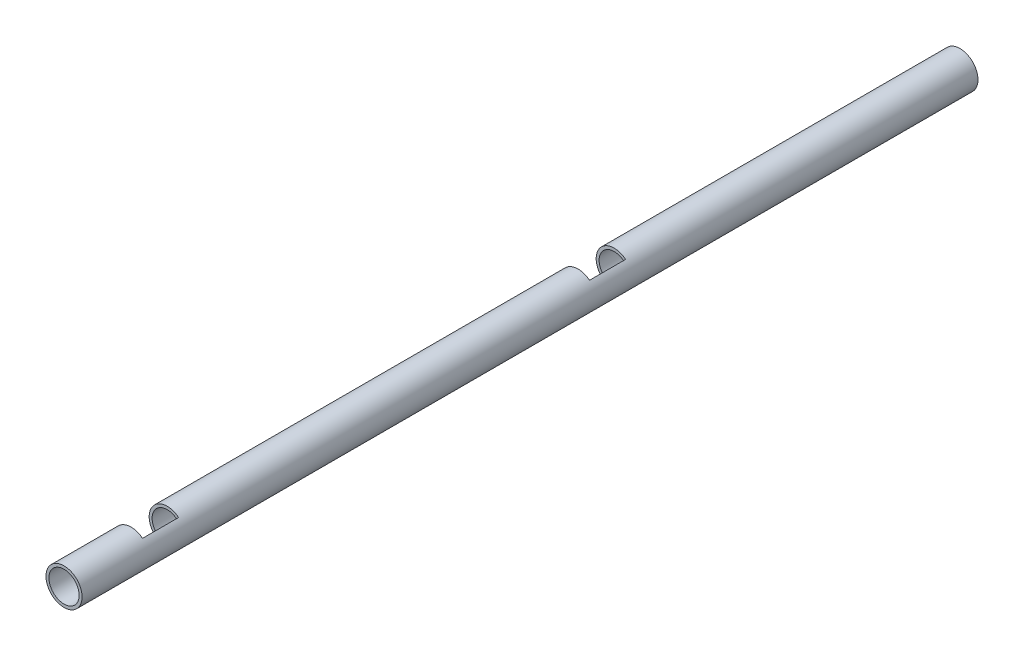
ISO-10303-21;
HEADER;
FILE_DESCRIPTION(('STEP AP214'),'2;1');
FILE_NAME('part.step','',(''),(''),'','','');
FILE_SCHEMA(('AUTOMOTIVE_DESIGN { 1 0 10303 214 1 1 1 1 }'));
ENDSEC;
DATA;
#1=APPLICATION_CONTEXT('core data for automotive mechanical design processes');
#2=APPLICATION_PROTOCOL_DEFINITION('international standard','automotive_design',2000,#1);
#3=PRODUCT_CONTEXT('',#1,'mechanical');
#4=PRODUCT('Part','Part','',(#3));
#5=PRODUCT_RELATED_PRODUCT_CATEGORY('part','',(#4));
#6=PRODUCT_DEFINITION_FORMATION('','',#4);
#7=PRODUCT_DEFINITION_CONTEXT('part definition',#1,'design');
#8=PRODUCT_DEFINITION('design','',#6,#7);
#9=PRODUCT_DEFINITION_SHAPE('','',#8);
#10=(LENGTH_UNIT() NAMED_UNIT(*) SI_UNIT(.MILLI.,.METRE.));
#11=(NAMED_UNIT(*) PLANE_ANGLE_UNIT() SI_UNIT($,.RADIAN.));
#12=(NAMED_UNIT(*) SI_UNIT($,.STERADIAN.) SOLID_ANGLE_UNIT());
#13=UNCERTAINTY_MEASURE_WITH_UNIT(LENGTH_MEASURE(1.E-05),#10,'distance_accuracy_value','');
#14=(GEOMETRIC_REPRESENTATION_CONTEXT(3) GLOBAL_UNCERTAINTY_ASSIGNED_CONTEXT((#13)) GLOBAL_UNIT_ASSIGNED_CONTEXT((#10,
#11,#12)) REPRESENTATION_CONTEXT('',''));
#15=CARTESIAN_POINT('',(0.,0.,0.));
#16=DIRECTION('',(0.,0.,1.));
#17=DIRECTION('',(1.,0.,0.));
#18=AXIS2_PLACEMENT_3D('',#15,#16,#17);
#19=CARTESIAN_POINT('',(0.3932,0.481952030808046,0.933));
#20=DIRECTION('',(-0.774842493260524,0.632154340836013,0.));
#21=DIRECTION('',(0.,0.,1.));
#22=AXIS2_PLACEMENT_3D('',#19,#20,#21);
#23=PLANE('',#22);
#24=DIRECTION('',(0.632154340836013,0.774842493260524,0.));
#25=VECTOR('',#24,1.);
#26=CARTESIAN_POINT('',(0.3932,0.481952030808046,0.311));
#27=LINE('',#26,#25);
#28=CARTESIAN_POINT('',(0.3291084,0.403393849786335,0.311));
#29=VERTEX_POINT('',#28);
#30=CARTESIAN_POINT('',(0.3932,0.481952030808046,0.311));
#31=VERTEX_POINT('',#30);
#32=EDGE_CURVE('E50',#29,#31,#27,.T.);
#33=ORIENTED_EDGE('',*,*,#32,.F.);
#34=DIRECTION('',(0.,0.,1.));
#35=VECTOR('',#34,1.);
#36=CARTESIAN_POINT('',(0.3291084,0.403393849786335,0.));
#37=LINE('',#36,#35);
#38=CARTESIAN_POINT('',(0.3291084,0.403393849786335,1.555));
#39=VERTEX_POINT('',#38);
#40=EDGE_CURVE('E94',#29,#39,#37,.T.);
#41=ORIENTED_EDGE('',*,*,#40,.T.);
#42=DIRECTION('',(0.632154340836013,0.774842493260524,0.));
#43=VECTOR('',#42,1.);
#44=CARTESIAN_POINT('',(0.3932,0.481952030808046,1.555));
#45=LINE('',#44,#43);
#46=CARTESIAN_POINT('',(0.3932,0.481952030808046,1.555));
#47=VERTEX_POINT('',#46);
#48=EDGE_CURVE('E68',#39,#47,#45,.T.);
#49=ORIENTED_EDGE('',*,*,#48,.T.);
#50=DIRECTION('',(0.,0.,1.));
#51=VECTOR('',#50,1.);
#52=CARTESIAN_POINT('',(0.3932,0.481952030808046,0.));
#53=LINE('',#52,#51);
#54=EDGE_CURVE('E146',#31,#47,#53,.T.);
#55=ORIENTED_EDGE('',*,*,#54,.F.);
#56=EDGE_LOOP('',(#33,#41,#49,#55));
#57=FACE_BOUND('',#56,.T.);
#58=ADVANCED_FACE('F37',(#57),#23,.T.);
#59=CARTESIAN_POINT('',(0.,0.,1.555));
#60=DIRECTION('',(0.,0.,1.));
#61=DIRECTION('',(1.,0.,0.));
#62=AXIS2_PLACEMENT_3D('',#59,#60,#61);
#63=PLANE('',#62);
#64=ORIENTED_EDGE('',*,*,#48,.F.);
#65=CARTESIAN_POINT('',(0.,0.,1.555));
#66=DIRECTION('',(0.,0.,1.));
#67=DIRECTION('',(1.,0.,0.));
#68=AXIS2_PLACEMENT_3D('',#65,#66,#67);
#69=CIRCLE('',#68,0.520614);
#70=CARTESIAN_POINT('',(0.3291084,-0.403393849786335,1.555));
#71=VERTEX_POINT('',#70);
#72=EDGE_CURVE('E150',#39,#71,#69,.T.);
#73=ORIENTED_EDGE('',*,*,#72,.T.);
#74=DIRECTION('',(0.632154340836013,-0.774842493260524,0.));
#75=VECTOR('',#74,1.);
#76=CARTESIAN_POINT('',(0.3932,-0.481952030808046,1.555));
#77=LINE('',#76,#75);
#78=CARTESIAN_POINT('',(0.3932,-0.481952030808046,1.555));
#79=VERTEX_POINT('',#78);
#80=EDGE_CURVE('E103',#71,#79,#77,.T.);
#81=ORIENTED_EDGE('',*,*,#80,.T.);
#82=CARTESIAN_POINT('',(0.,0.,1.555));
#83=DIRECTION('',(0.,0.,-1.));
#84=DIRECTION('',(-1.,0.,0.));
#85=AXIS2_PLACEMENT_3D('',#82,#83,#84);
#86=CIRCLE('',#85,0.622);
#87=EDGE_CURVE('E95',#47,#79,#86,.F.);
#88=ORIENTED_EDGE('',*,*,#87,.F.);
#89=EDGE_LOOP('',(#64,#73,#81,#88));
#90=FACE_BOUND('',#89,.T.);
#91=ADVANCED_FACE('F138',(#90),#63,.F.);
#92=CARTESIAN_POINT('',(0.,0.,0.311));
#93=DIRECTION('',(0.,0.,-1.));
#94=DIRECTION('',(-1.,0.,0.));
#95=AXIS2_PLACEMENT_3D('',#92,#93,#94);
#96=PLANE('',#95);
#97=CARTESIAN_POINT('',(0.,0.,0.311));
#98=DIRECTION('',(0.,0.,1.));
#99=DIRECTION('',(1.,0.,0.));
#100=AXIS2_PLACEMENT_3D('',#97,#98,#99);
#101=CIRCLE('',#100,0.520614);
#102=CARTESIAN_POINT('',(0.3291084,-0.403393849786335,0.311));
#103=VERTEX_POINT('',#102);
#104=EDGE_CURVE('E87',#103,#29,#101,.F.);
#105=ORIENTED_EDGE('',*,*,#104,.T.);
#106=ORIENTED_EDGE('',*,*,#32,.T.);
#107=CARTESIAN_POINT('',(0.,0.,0.311));
#108=DIRECTION('',(0.,0.,1.));
#109=DIRECTION('',(1.,0.,0.));
#110=AXIS2_PLACEMENT_3D('',#107,#108,#109);
#111=CIRCLE('',#110,0.622);
#112=CARTESIAN_POINT('',(0.3932,-0.481952030808046,0.311));
#113=VERTEX_POINT('',#112);
#114=EDGE_CURVE('E74',#113,#31,#111,.F.);
#115=ORIENTED_EDGE('',*,*,#114,.F.);
#116=DIRECTION('',(0.632154340836013,-0.774842493260524,0.));
#117=VECTOR('',#116,1.);
#118=CARTESIAN_POINT('',(0.3932,-0.481952030808046,0.311));
#119=LINE('',#118,#117);
#120=EDGE_CURVE('E101',#103,#113,#119,.T.);
#121=ORIENTED_EDGE('',*,*,#120,.F.);
#122=EDGE_LOOP('',(#105,#106,#115,#121));
#123=FACE_BOUND('',#122,.T.);
#124=ADVANCED_FACE('F39',(#123),#96,.F.);
#125=CARTESIAN_POINT('',(0.,0.,0.));
#126=DIRECTION('',(0.,0.,1.));
#127=DIRECTION('',(1.,0.,0.));
#128=AXIS2_PLACEMENT_3D('',#125,#126,#127);
#129=CYLINDRICAL_SURFACE('',#128,0.622);
#130=CARTESIAN_POINT('',(-0.622,0.,3.255));
#131=CARTESIAN_POINT('',(-0.621999577929827,0.0109193633288384,3.25499939308507));
#132=CARTESIAN_POINT('',(-0.621709329938003,0.0218502270294627,3.25410161503433));
#133=CARTESIAN_POINT('',(-0.620578112855119,0.0434024432020149,3.25054010866013));
#134=CARTESIAN_POINT('',(-0.619736207669613,0.0540232374685382,3.24787337854731));
#135=CARTESIAN_POINT('',(-0.617593869971351,0.0746246518911455,3.24087419082279));
#136=CARTESIAN_POINT('',(-0.616294450412361,0.084606629178181,3.23654541114978));
#137=CARTESIAN_POINT('',(-0.613370888019472,0.103699386181398,3.22635803819557));
#138=CARTESIAN_POINT('',(-0.611746791297651,0.112810289340036,3.22049966211826));
#139=CARTESIAN_POINT('',(-0.608286102372988,0.130203719158425,3.20721765206123));
#140=CARTESIAN_POINT('',(-0.606444663928166,0.138453985198494,3.19975303528528));
#141=CARTESIAN_POINT('',(-0.602784240920798,0.153610144329197,3.18355730894605));
#142=CARTESIAN_POINT('',(-0.600965262165017,0.160515696300347,3.17482587900247));
#143=CARTESIAN_POINT('',(-0.597503530771229,0.172963818804696,3.15606209326497));
#144=CARTESIAN_POINT('',(-0.595866696764659,0.178465603211153,3.14600148309368));
#145=CARTESIAN_POINT('',(-0.59302745289626,0.187685596399211,3.12503670826931));
#146=CARTESIAN_POINT('',(-0.591824918677886,0.191404315840202,3.11413278617599));
#147=CARTESIAN_POINT('',(-0.590041030843827,0.196833859126491,3.09215455937568));
#148=CARTESIAN_POINT('',(-0.589441214579351,0.198604530142793,3.08109658086054));
#149=CARTESIAN_POINT('',(-0.588875945894283,0.200274737992443,3.05882547613999));
#150=CARTESIAN_POINT('',(-0.588910313539343,0.200174805564168,3.04761239484344));
#151=CARTESIAN_POINT('',(-0.5895932815845,0.198153311328794,3.02585096574481));
#152=CARTESIAN_POINT('',(-0.590215937903086,0.196308688317999,3.01529451770903));
#153=CARTESIAN_POINT('',(-0.591963052928187,0.190975230611651,2.99464966713254));
#154=CARTESIAN_POINT('',(-0.593087570309907,0.187486203657546,2.9845613194722));
#155=CARTESIAN_POINT('',(-0.595731017518543,0.178910257031212,2.96495920845102));
#156=CARTESIAN_POINT('',(-0.597255714099062,0.173799725062294,2.95545658672679));
#157=CARTESIAN_POINT('',(-0.600525069528976,0.162142523518303,2.9374194725291));
#158=CARTESIAN_POINT('',(-0.602269776064023,0.155595542374401,2.92888519070081));
#159=CARTESIAN_POINT('',(-0.605885585651294,0.140878299077212,2.91259381155107));
#160=CARTESIAN_POINT('',(-0.607758727443434,0.132645000236176,2.90489400937033));
#161=CARTESIAN_POINT('',(-0.611347152244488,0.11497740187755,2.8909672538188));
#162=CARTESIAN_POINT('',(-0.613062366497891,0.105542583485075,2.8847409401126));
#163=CARTESIAN_POINT('',(-0.616161845004992,0.085621864039235,2.87389576386484));
#164=CARTESIAN_POINT('',(-0.617542856982662,0.0751269410421353,2.86929251303984));
#165=CARTESIAN_POINT('',(-0.619792686366073,0.0534683769053918,2.8619420636265));
#166=CARTESIAN_POINT('',(-0.620662554643341,0.0423061601262099,2.85919105526121));
#167=CARTESIAN_POINT('',(-0.62148320570485,0.0258683835589917,2.85661195013316));
#168=CARTESIAN_POINT('',(-0.621676438455423,0.0207159916137967,2.856008193597));
#169=CARTESIAN_POINT('',(-0.621934936052819,0.0103765990587501,2.85520207383045));
#170=CARTESIAN_POINT('',(-0.622000200595461,0.00518959836666247,2.85499971155417));
#171=CARTESIAN_POINT('',(-0.621999577929833,-0.0109193633288352,2.85500060691491));
#172=CARTESIAN_POINT('',(-0.621709329938004,-0.0218502270294587,2.85589838496567));
#173=CARTESIAN_POINT('',(-0.620578112855118,-0.043402443202011,2.85945989133988));
#174=CARTESIAN_POINT('',(-0.619736207669612,-0.0540232374685351,2.86212662145269));
#175=CARTESIAN_POINT('',(-0.617593869971352,-0.0746246518911436,2.86912580917721));
#176=CARTESIAN_POINT('',(-0.616294450412361,-0.0846066291781793,2.87345458885023));
#177=CARTESIAN_POINT('',(-0.613370888019472,-0.103699386181397,2.88364196180443));
#178=CARTESIAN_POINT('',(-0.611746791297651,-0.112810289340034,2.88950033788174));
#179=CARTESIAN_POINT('',(-0.608286102372988,-0.130203719158423,2.90278234793877));
#180=CARTESIAN_POINT('',(-0.606444663928167,-0.138453985198492,2.91024696471473));
#181=CARTESIAN_POINT('',(-0.602784240920799,-0.153610144329195,2.92644269105395));
#182=CARTESIAN_POINT('',(-0.600965262165018,-0.160515696300345,2.93517412099753));
#183=CARTESIAN_POINT('',(-0.597503530771229,-0.172963818804695,2.95393790673503));
#184=CARTESIAN_POINT('',(-0.595866696764659,-0.178465603211152,2.96399851690632));
#185=CARTESIAN_POINT('',(-0.59302745289626,-0.18768559639921,2.98496329173069));
#186=CARTESIAN_POINT('',(-0.591824918677886,-0.191404315840201,2.99586721382401));
#187=CARTESIAN_POINT('',(-0.590041030843827,-0.19683385912649,3.01784544062433));
#188=CARTESIAN_POINT('',(-0.589441214579351,-0.198604530142793,3.02890341913946));
#189=CARTESIAN_POINT('',(-0.588875945894283,-0.200274737992443,3.05117452386001));
#190=CARTESIAN_POINT('',(-0.588910313539343,-0.200174805564168,3.06238760515656));
#191=CARTESIAN_POINT('',(-0.589593281584499,-0.198153311328794,3.08414903425519));
#192=CARTESIAN_POINT('',(-0.590215937903085,-0.196308688317999,3.09470548229098));
#193=CARTESIAN_POINT('',(-0.591963052928186,-0.190975230611652,3.11535033286747));
#194=CARTESIAN_POINT('',(-0.593087570309907,-0.187486203657546,3.12543868052781));
#195=CARTESIAN_POINT('',(-0.595731017518543,-0.178910257031213,3.14504079154898));
#196=CARTESIAN_POINT('',(-0.597255714099062,-0.173799725062295,3.15454341327321));
#197=CARTESIAN_POINT('',(-0.600525069528976,-0.162142523518304,3.1725805274709));
#198=CARTESIAN_POINT('',(-0.602269776064023,-0.155595542374403,3.1811148092992));
#199=CARTESIAN_POINT('',(-0.605885585651293,-0.140878299077214,3.19740618844893));
#200=CARTESIAN_POINT('',(-0.607758727443434,-0.132645000236178,3.20510599062967));
#201=CARTESIAN_POINT('',(-0.611347152244487,-0.114977401877552,3.2190327461812));
#202=CARTESIAN_POINT('',(-0.613062366497891,-0.105542583485077,3.2252590598874));
#203=CARTESIAN_POINT('',(-0.616161845004992,-0.0856218640392371,3.23610423613517));
#204=CARTESIAN_POINT('',(-0.617542856982662,-0.0751269410421372,3.24070748696017));
#205=CARTESIAN_POINT('',(-0.619792686366072,-0.0534683769053936,3.2480579363735));
#206=CARTESIAN_POINT('',(-0.62066255464334,-0.0423061601262121,3.25080894473879));
#207=CARTESIAN_POINT('',(-0.62148320570485,-0.0258683835589938,3.25338804986684));
#208=CARTESIAN_POINT('',(-0.621676438455424,-0.0207159916137982,3.253991806403));
#209=CARTESIAN_POINT('',(-0.621934936052818,-0.0103765990587499,3.25479792616955));
#210=CARTESIAN_POINT('',(-0.622000200595457,-0.00518959836666119,3.25500028844582));
#211=CARTESIAN_POINT('',(-0.622,0.,3.255));
#212=B_SPLINE_CURVE_WITH_KNOTS('',3,(#130,#131,#132,#133,#134,#135,#136,#137,#138,#139,#140,
#141,#142,#143,#144,#145,#146,#147,#148,#149,#150,#151,#152,#153,#154,#155,#156,#157,#158,#159,
#160,#161,#162,#163,#164,#165,#166,#167,#168,#169,#170,#171,#172,#173,#174,#175,#176,#177,#178,
#179,#180,#181,#182,#183,#184,#185,#186,#187,#188,#189,#190,#191,#192,#193,#194,#195,#196,#197,
#198,#199,#200,#201,#202,#203,#204,#205,#206,#207,#208,#209,#210,#211),.UNSPECIFIED.,.T.,.F.,(4,
2,2,2,2,2,2,2,2,2,2,2,2,2,2,2,2,2,2,2,2,2,2,2,2,2,2,2,2,2,2,2,2,2,2,2,2,2,2,2,4),(0.,
0.0327380856553518,0.0655318681835637,0.0982534959600798,0.130970479764623,0.164650092297729,
0.198338237386976,0.232915564706204,0.267482983357219,0.300955906343575,0.334419332343534,
0.366472648404573,0.398529712968826,0.431076848275393,0.463631050114921,0.497754520395141,
0.531892777149167,0.566350973681964,0.600738076718817,0.616297327462757,0.631856615191181,
0.664594700846532,0.697388483374746,0.730110111151263,0.762827094955805,0.79650670748891,
0.830194852578158,0.864772179897386,0.899339598548402,0.932812521534758,0.966275947534716,
0.998329263595756,1.03038632816001,1.06293346346658,1.0954876653061,1.12961113558632,
1.16374939234035,1.19820758887315,1.23259469191,1.24815394265394,1.26371323038237),.UNSPECIFIED.);
#213=CARTESIAN_POINT('',(-0.622,0.,3.255));
#214=VERTEX_POINT('',#213);
#215=EDGE_CURVE('E107',#214,#214,#212,.T.);
#216=ORIENTED_EDGE('',*,*,#215,.F.);
#217=EDGE_LOOP('',(#216));
#218=FACE_BOUND('',#217,.T.);
#219=CARTESIAN_POINT('',(0.,0.,3.866));
#220=DIRECTION('',(0.,0.,1.));
#221=DIRECTION('',(1.,0.,0.));
#222=AXIS2_PLACEMENT_3D('',#219,#220,#221);
#223=CIRCLE('',#222,0.622);
#224=CARTESIAN_POINT('',(0.622,0.,3.866));
#225=VERTEX_POINT('',#224);
#226=EDGE_CURVE('E110',#225,#225,#223,.T.);
#227=ORIENTED_EDGE('',*,*,#226,.F.);
#228=EDGE_LOOP('',(#227));
#229=FACE_BOUND('',#228,.T.);
#230=ORIENTED_EDGE('',*,*,#87,.T.);
#231=DIRECTION('',(0.,0.,1.));
#232=VECTOR('',#231,1.);
#233=CARTESIAN_POINT('',(0.3932,-0.481952030808046,0.));
#234=LINE('',#233,#232);
#235=EDGE_CURVE('E104',#113,#79,#234,.T.);
#236=ORIENTED_EDGE('',*,*,#235,.F.);
#237=ORIENTED_EDGE('',*,*,#114,.T.);
#238=ORIENTED_EDGE('',*,*,#54,.T.);
#239=EDGE_LOOP('',(#230,#236,#237,#238));
#240=FACE_BOUND('',#239,.T.);
#241=CARTESIAN_POINT('',(-0.622000000000004,0.,-12.145));
#242=CARTESIAN_POINT('',(-0.621999577929831,0.0109193633288384,-12.1450006069149));
#243=CARTESIAN_POINT('',(-0.621709329938006,0.0218502270294627,-12.1458983849657));
#244=CARTESIAN_POINT('',(-0.620578112855123,0.0434024432020148,-12.1494598913399));
#245=CARTESIAN_POINT('',(-0.619736207669616,0.0540232374685382,-12.1521266214527));
#246=CARTESIAN_POINT('',(-0.617593869971355,0.0746246518911454,-12.1591258091772));
#247=CARTESIAN_POINT('',(-0.616294450412364,0.0846066291781807,-12.1634545888502));
#248=CARTESIAN_POINT('',(-0.613370888019476,0.103699386181398,-12.1736419618044));
#249=CARTESIAN_POINT('',(-0.611746791297655,0.112810289340036,-12.1795003378817));
#250=CARTESIAN_POINT('',(-0.608286102372991,0.130203719158425,-12.1927823479388));
#251=CARTESIAN_POINT('',(-0.60644466392817,0.138453985198494,-12.2002469647147));
#252=CARTESIAN_POINT('',(-0.602784240920802,0.153610144329197,-12.2164426910539));
#253=CARTESIAN_POINT('',(-0.600965262165021,0.160515696300347,-12.2251741209975));
#254=CARTESIAN_POINT('',(-0.597503530771232,0.172963818804696,-12.243937906735));
#255=CARTESIAN_POINT('',(-0.595866696764663,0.178465603211153,-12.2539985169063));
#256=CARTESIAN_POINT('',(-0.593027452896264,0.187685596399211,-12.2749632917307));
#257=CARTESIAN_POINT('',(-0.59182491867789,0.191404315840202,-12.285867213824));
#258=CARTESIAN_POINT('',(-0.590041030843831,0.196833859126491,-12.3078454406243));
#259=CARTESIAN_POINT('',(-0.589441214579355,0.198604530142793,-12.3189034191395));
#260=CARTESIAN_POINT('',(-0.588875945894287,0.200274737992443,-12.34117452386));
#261=CARTESIAN_POINT('',(-0.588910313539347,0.200174805564168,-12.3523876051566));
#262=CARTESIAN_POINT('',(-0.589593281584503,0.198153311328794,-12.3741490342552));
#263=CARTESIAN_POINT('',(-0.590215937903089,0.196308688317999,-12.384705482291));
#264=CARTESIAN_POINT('',(-0.59196305292819,0.190975230611651,-12.4053503328675));
#265=CARTESIAN_POINT('',(-0.593087570309911,0.187486203657546,-12.4154386805278));
#266=CARTESIAN_POINT('',(-0.595731017518547,0.178910257031212,-12.435040791549));
#267=CARTESIAN_POINT('',(-0.597255714099066,0.173799725062293,-12.4445434132732));
#268=CARTESIAN_POINT('',(-0.60052506952898,0.162142523518302,-12.4625805274709));
#269=CARTESIAN_POINT('',(-0.602269776064027,0.155595542374401,-12.4711148092992));
#270=CARTESIAN_POINT('',(-0.605885585651297,0.140878299077212,-12.4874061884489));
#271=CARTESIAN_POINT('',(-0.607758727443438,0.132645000236176,-12.4951059906297));
#272=CARTESIAN_POINT('',(-0.611347152244492,0.114977401877549,-12.5090327461812));
#273=CARTESIAN_POINT('',(-0.613062366497895,0.105542583485074,-12.5152590598874));
#274=CARTESIAN_POINT('',(-0.616161845004996,0.0856218640392351,-12.5261042361352));
#275=CARTESIAN_POINT('',(-0.617542856982666,0.0751269410421355,-12.5307074869602));
#276=CARTESIAN_POINT('',(-0.619792686366076,0.0534683769053919,-12.5380579363735));
#277=CARTESIAN_POINT('',(-0.620662554643345,0.0423061601262099,-12.5408089447388));
#278=CARTESIAN_POINT('',(-0.621483205704854,0.0258683835589917,-12.5433880498668));
#279=CARTESIAN_POINT('',(-0.621676438455426,0.0207159916137967,-12.543991806403));
#280=CARTESIAN_POINT('',(-0.621934936052822,0.0103765990587501,-12.5447979261696));
#281=CARTESIAN_POINT('',(-0.622000200595464,0.00518959836666247,-12.5450002884458));
#282=CARTESIAN_POINT('',(-0.621999577929837,-0.0109193633288349,-12.5449993930851));
#283=CARTESIAN_POINT('',(-0.621709329938008,-0.0218502270294583,-12.5441016150343));
#284=CARTESIAN_POINT('',(-0.620578112855122,-0.0434024432020105,-12.5405401086601));
#285=CARTESIAN_POINT('',(-0.619736207669616,-0.0540232374685349,-12.5378733785473));
#286=CARTESIAN_POINT('',(-0.617593869971355,-0.074624651891143,-12.5308741908228));
#287=CARTESIAN_POINT('',(-0.616294450412365,-0.0846066291781782,-12.5265454111498));
#288=CARTESIAN_POINT('',(-0.613370888019476,-0.103699386181396,-12.5163580381956));
#289=CARTESIAN_POINT('',(-0.611746791297655,-0.112810289340034,-12.5104996621183));
#290=CARTESIAN_POINT('',(-0.608286102372992,-0.130203719158423,-12.4972176520612));
#291=CARTESIAN_POINT('',(-0.60644466392817,-0.138453985198491,-12.4897530352853));
#292=CARTESIAN_POINT('',(-0.602784240920803,-0.153610144329195,-12.4735573089461));
#293=CARTESIAN_POINT('',(-0.600965262165021,-0.160515696300345,-12.4648258790025));
#294=CARTESIAN_POINT('',(-0.597503530771233,-0.172963818804695,-12.446062093265));
#295=CARTESIAN_POINT('',(-0.595866696764663,-0.178465603211151,-12.4360014830937));
#296=CARTESIAN_POINT('',(-0.593027452896264,-0.18768559639921,-12.4150367082693));
#297=CARTESIAN_POINT('',(-0.59182491867789,-0.191404315840201,-12.404132786176));
#298=CARTESIAN_POINT('',(-0.590041030843831,-0.19683385912649,-12.3821545593757));
#299=CARTESIAN_POINT('',(-0.589441214579355,-0.198604530142793,-12.3710965808605));
#300=CARTESIAN_POINT('',(-0.588875945894287,-0.200274737992443,-12.34882547614));
#301=CARTESIAN_POINT('',(-0.588910313539347,-0.200174805564168,-12.3376123948434));
#302=CARTESIAN_POINT('',(-0.589593281584503,-0.198153311328795,-12.3158509657448));
#303=CARTESIAN_POINT('',(-0.590215937903089,-0.196308688318,-12.305294517709));
#304=CARTESIAN_POINT('',(-0.59196305292819,-0.190975230611652,-12.2846496671325));
#305=CARTESIAN_POINT('',(-0.59308757030991,-0.187486203657547,-12.2745613194722));
#306=CARTESIAN_POINT('',(-0.595731017518547,-0.178910257031213,-12.254959208451));
#307=CARTESIAN_POINT('',(-0.597255714099066,-0.173799725062294,-12.2454565867268));
#308=CARTESIAN_POINT('',(-0.60052506952898,-0.162142523518303,-12.2274194725291));
#309=CARTESIAN_POINT('',(-0.602269776064027,-0.155595542374402,-12.2188851907008));
#310=CARTESIAN_POINT('',(-0.605885585651297,-0.140878299077214,-12.2025938115511));
#311=CARTESIAN_POINT('',(-0.607758727443438,-0.132645000236178,-12.1948940093703));
#312=CARTESIAN_POINT('',(-0.611347152244491,-0.114977401877552,-12.1809672538188));
#313=CARTESIAN_POINT('',(-0.613062366497894,-0.105542583485077,-12.1747409401126));
#314=CARTESIAN_POINT('',(-0.616161845004996,-0.0856218640392372,-12.1638957638648));
#315=CARTESIAN_POINT('',(-0.617542856982666,-0.0751269410421374,-12.1592925130398));
#316=CARTESIAN_POINT('',(-0.619792686366076,-0.053468376905394,-12.1519420636265));
#317=CARTESIAN_POINT('',(-0.620662554643344,-0.0423061601262123,-12.1491910552612));
#318=CARTESIAN_POINT('',(-0.621483205704854,-0.0258683835589938,-12.1466119501332));
#319=CARTESIAN_POINT('',(-0.621676438455427,-0.0207159916137983,-12.146008193597));
#320=CARTESIAN_POINT('',(-0.621934936052822,-0.01037659905875,-12.1452020738304));
#321=CARTESIAN_POINT('',(-0.622000200595461,-0.00518959836666123,-12.1449997115542));
#322=CARTESIAN_POINT('',(-0.622000000000004,0.,-12.145));
#323=B_SPLINE_CURVE_WITH_KNOTS('',3,(#241,#242,#243,#244,#245,#246,#247,#248,#249,#250,#251,
#252,#253,#254,#255,#256,#257,#258,#259,#260,#261,#262,#263,#264,#265,#266,#267,#268,#269,#270,
#271,#272,#273,#274,#275,#276,#277,#278,#279,#280,#281,#282,#283,#284,#285,#286,#287,#288,#289,
#290,#291,#292,#293,#294,#295,#296,#297,#298,#299,#300,#301,#302,#303,#304,#305,#306,#307,#308,
#309,#310,#311,#312,#313,#314,#315,#316,#317,#318,#319,#320,#321,#322),.UNSPECIFIED.,.T.,.F.,(4,
2,2,2,2,2,2,2,2,2,2,2,2,2,2,2,2,2,2,2,2,2,2,2,2,2,2,2,2,2,2,2,2,2,2,2,2,2,2,2,4),(0.,
0.0327380856553516,0.065531868183564,0.0982534959600798,0.130970479764622,0.164650092297729,
0.198338237386975,0.232915564706203,0.26748298335722,0.300955906343575,0.334419332343534,
0.366472648404573,0.398529712968826,0.431076848275393,0.463631050114921,0.497754520395142,
0.531892777149166,0.566350973681963,0.600738076718816,0.616297327462756,0.631856615191181,
0.664594700846531,0.697388483374746,0.730110111151261,0.762827094955804,0.79650670748891,
0.830194852578158,0.864772179897386,0.899339598548401,0.932812521534756,0.966275947534715,
0.998329263595755,1.03038632816001,1.06293346346658,1.0954876653061,1.12961113558632,
1.16374939234035,1.19820758887315,1.23259469191,1.24815394265394,1.26371323038237),.UNSPECIFIED.);
#324=CARTESIAN_POINT('',(-0.622000000000004,0.,-12.145));
#325=VERTEX_POINT('',#324);
#326=EDGE_CURVE('E166',#325,#325,#323,.T.);
#327=ORIENTED_EDGE('',*,*,#326,.F.);
#328=EDGE_LOOP('',(#327));
#329=FACE_BOUND('',#328,.T.);
#330=CARTESIAN_POINT('',(0.,0.,-13.845));
#331=DIRECTION('',(0.,0.,-1.));
#332=DIRECTION('',(-1.,0.,0.));
#333=AXIS2_PLACEMENT_3D('',#330,#331,#332);
#334=CIRCLE('',#333,0.622);
#335=CARTESIAN_POINT('',(0.393199999999996,0.481952030808046,-13.845));
#336=VERTEX_POINT('',#335);
#337=CARTESIAN_POINT('',(0.393199999999996,-0.481952030808046,-13.845));
#338=VERTEX_POINT('',#337);
#339=EDGE_CURVE('E173',#336,#338,#334,.F.);
#340=ORIENTED_EDGE('',*,*,#339,.T.);
#341=DIRECTION('',(0.,0.,1.));
#342=VECTOR('',#341,1.);
#343=CARTESIAN_POINT('',(0.393199999999996,-0.481952030808046,-15.4));
#344=LINE('',#343,#342);
#345=CARTESIAN_POINT('',(0.393199999999996,-0.481952030808046,-15.089));
#346=VERTEX_POINT('',#345);
#347=EDGE_CURVE('E271',#346,#338,#344,.T.);
#348=ORIENTED_EDGE('',*,*,#347,.F.);
#349=CARTESIAN_POINT('',(0.,0.,-15.089));
#350=DIRECTION('',(0.,0.,1.));
#351=DIRECTION('',(1.,0.,0.));
#352=AXIS2_PLACEMENT_3D('',#349,#350,#351);
#353=CIRCLE('',#352,0.622);
#354=CARTESIAN_POINT('',(0.393199999999996,0.481952030808046,-15.089));
#355=VERTEX_POINT('',#354);
#356=EDGE_CURVE('E196',#346,#355,#353,.F.);
#357=ORIENTED_EDGE('',*,*,#356,.T.);
#358=DIRECTION('',(0.,0.,1.));
#359=VECTOR('',#358,1.);
#360=CARTESIAN_POINT('',(0.393199999999996,0.481952030808046,-15.4));
#361=LINE('',#360,#359);
#362=EDGE_CURVE('E193',#355,#336,#361,.T.);
#363=ORIENTED_EDGE('',*,*,#362,.T.);
#364=EDGE_LOOP('',(#340,#348,#357,#363));
#365=FACE_BOUND('',#364,.T.);
#366=CARTESIAN_POINT('',(0.,0.,-27.));
#367=DIRECTION('',(0.,0.,-1.));
#368=DIRECTION('',(-1.,0.,0.));
#369=AXIS2_PLACEMENT_3D('',#366,#367,#368);
#370=CIRCLE('',#369,0.622);
#371=CARTESIAN_POINT('',(-0.622000000000004,0.,-27.));
#372=VERTEX_POINT('',#371);
#373=EDGE_CURVE('E177',#372,#372,#370,.T.);
#374=ORIENTED_EDGE('',*,*,#373,.F.);
#375=EDGE_LOOP('',(#374));
#376=FACE_BOUND('',#375,.T.);
#377=ADVANCED_FACE('F118',(#218,#229,#240,#329,#365,#376),#129,.T.);
#378=CARTESIAN_POINT('',(0.,0.,0.));
#379=DIRECTION('',(0.,0.,1.));
#380=DIRECTION('',(1.,0.,0.));
#381=AXIS2_PLACEMENT_3D('',#378,#379,#380);
#382=CYLINDRICAL_SURFACE('',#381,0.520614);
#383=CARTESIAN_POINT('',(-0.520614,0.,3.255));
#384=CARTESIAN_POINT('',(-0.520613514689114,0.0107956701120087,3.25499937381276));
#385=CARTESIAN_POINT('',(-0.520274634314805,0.0216012044258957,3.25412169078187));
#386=CARTESIAN_POINT('',(-0.518953603242681,0.0429001093390011,3.25064353234449));
#387=CARTESIAN_POINT('',(-0.517970491559685,0.0533929890741566,3.24804048318187));
#388=CARTESIAN_POINT('',(-0.515467170996157,0.0737382274317987,3.24121886699427));
#389=CARTESIAN_POINT('',(-0.513948400366225,0.0835922184170892,3.23700462352429));
#390=CARTESIAN_POINT('',(-0.510524407794475,0.102448673096471,3.22709816759491));
#391=CARTESIAN_POINT('',(-0.508619200560733,0.111451169180001,3.22140601138369));
#392=CARTESIAN_POINT('',(-0.504523374923858,0.128752900072884,3.2084411156542));
#393=CARTESIAN_POINT('',(-0.502324385367266,0.137009567903273,3.20111423454273));
#394=CARTESIAN_POINT('',(-0.497928940551434,0.152211856034185,3.18520255463404));
#395=CARTESIAN_POINT('',(-0.495732486539278,0.159156987475636,3.17661728889891));
#396=CARTESIAN_POINT('',(-0.4914925845933,0.171815042363856,3.15801064474767));
#397=CARTESIAN_POINT('',(-0.489458890180967,0.177466918989745,3.14794528888111));
#398=CARTESIAN_POINT('',(-0.485905241196104,0.186978631328272,3.12691659564903));
#399=CARTESIAN_POINT('',(-0.484385069683625,0.190839224034607,3.11595363991632));
#400=CARTESIAN_POINT('',(-0.482120130764399,0.196489388722502,3.093930258725));
#401=CARTESIAN_POINT('',(-0.48134507567526,0.198360218476035,3.08289390331718));
#402=CARTESIAN_POINT('',(-0.48056978092828,0.200231751889376,3.06063878623135));
#403=CARTESIAN_POINT('',(-0.480569199721746,0.200233279925003,3.04942010714231));
#404=CARTESIAN_POINT('',(-0.481316904110775,0.198428100816447,3.0278753438254));
#405=CARTESIAN_POINT('',(-0.482017784666322,0.196735858737024,3.01753771324575));
#406=CARTESIAN_POINT('',(-0.484010379390152,0.191780980630057,2.99730628041782));
#407=CARTESIAN_POINT('',(-0.485302189169175,0.188518090471456,2.98741255027597));
#408=CARTESIAN_POINT('',(-0.488358502567816,0.180454276834373,2.96812245420865));
#409=CARTESIAN_POINT('',(-0.490131736000887,0.175624590747232,2.95873955628492));
#410=CARTESIAN_POINT('',(-0.493948271745927,0.164584589481137,2.94088526995001));
#411=CARTESIAN_POINT('',(-0.495991658494739,0.158373842233771,2.93241416803002));
#412=CARTESIAN_POINT('',(-0.500294452493576,0.144231468047007,2.91599345908577));
#413=CARTESIAN_POINT('',(-0.502558920556002,0.136209242537717,2.90812301701501));
#414=CARTESIAN_POINT('',(-0.506925822119938,0.118930527519277,2.89381254534915));
#415=CARTESIAN_POINT('',(-0.509028179284183,0.109673462063506,2.88737318699076));
#416=CARTESIAN_POINT('',(-0.512879961730974,0.0899750494078034,2.87601390020555));
#417=CARTESIAN_POINT('',(-0.51462252956897,0.0795157371428964,2.87112268638634));
#418=CARTESIAN_POINT('',(-0.517504712621911,0.0578491298274874,2.86320339231079));
#419=CARTESIAN_POINT('',(-0.518645543355978,0.0466433945676825,2.86017155405159));
#420=CARTESIAN_POINT('',(-0.519813743081124,0.0294411677700754,2.85709050817924));
#421=CARTESIAN_POINT('',(-0.520112792421215,0.023585414928141,2.8563077511314));
#422=CARTESIAN_POINT('',(-0.520513053270646,0.0118207605769444,2.85526232687947));
#423=CARTESIAN_POINT('',(-0.520614265763031,0.00591185933192188,2.85499965709107));
#424=CARTESIAN_POINT('',(-0.520613514689164,-0.0107956701119829,2.85500062618711));
#425=CARTESIAN_POINT('',(-0.520274634314819,-0.021601204425864,2.85587830921809));
#426=CARTESIAN_POINT('',(-0.51895360324267,-0.0429001093389699,2.85935646765554));
#427=CARTESIAN_POINT('',(-0.517970491559684,-0.0533929890741315,2.86195951681814));
#428=CARTESIAN_POINT('',(-0.515467170996163,-0.0737382274317816,2.86878113300572));
#429=CARTESIAN_POINT('',(-0.513948400366228,-0.0835922184170742,2.87299537647571));
#430=CARTESIAN_POINT('',(-0.510524407794477,-0.102448673096457,2.88290183240509));
#431=CARTESIAN_POINT('',(-0.508619200560737,-0.111451169179984,2.8885939886163));
#432=CARTESIAN_POINT('',(-0.504523374923863,-0.128752900072867,2.90155888434579));
#433=CARTESIAN_POINT('',(-0.502324385367271,-0.137009567903256,2.90888576545726));
#434=CARTESIAN_POINT('',(-0.497928940551439,-0.152211856034169,2.92479744536594));
#435=CARTESIAN_POINT('',(-0.495732486539283,-0.159156987475621,2.93338271110108));
#436=CARTESIAN_POINT('',(-0.491492584593304,-0.171815042363845,2.95198935525232));
#437=CARTESIAN_POINT('',(-0.489458890180971,-0.177466918989734,2.96205471111888));
#438=CARTESIAN_POINT('',(-0.485905241196108,-0.186978631328264,2.98308340435095));
#439=CARTESIAN_POINT('',(-0.484385069683627,-0.190839224034599,2.99404636008367));
#440=CARTESIAN_POINT('',(-0.482120130764401,-0.196489388722498,3.01606974127498));
#441=CARTESIAN_POINT('',(-0.481345075675261,-0.198360218476031,3.0271060966828));
#442=CARTESIAN_POINT('',(-0.48056978092828,-0.200231751889376,3.04936121376864));
#443=CARTESIAN_POINT('',(-0.480569199721746,-0.200233279925004,3.06057989285768));
#444=CARTESIAN_POINT('',(-0.481316904110774,-0.19842810081645,3.08212465617459));
#445=CARTESIAN_POINT('',(-0.482017784666321,-0.196735858737028,3.09246228675423));
#446=CARTESIAN_POINT('',(-0.484010379390149,-0.191780980630063,3.11269371958217));
#447=CARTESIAN_POINT('',(-0.485302189169172,-0.188518090471463,3.12258744972402));
#448=CARTESIAN_POINT('',(-0.488358502567812,-0.180454276834382,3.14187754579134));
#449=CARTESIAN_POINT('',(-0.490131736000884,-0.175624590747241,3.15126044371507));
#450=CARTESIAN_POINT('',(-0.493948271745923,-0.164584589481148,3.16911473004997));
#451=CARTESIAN_POINT('',(-0.495991658494734,-0.158373842233784,3.17758583196996));
#452=CARTESIAN_POINT('',(-0.500294452493572,-0.144231468047023,3.19400654091422));
#453=CARTESIAN_POINT('',(-0.502558920555997,-0.136209242537736,3.20187698298498));
#454=CARTESIAN_POINT('',(-0.506925822119933,-0.118930527519298,3.21618745465084));
#455=CARTESIAN_POINT('',(-0.509028179284179,-0.109673462063527,3.22262681300923));
#456=CARTESIAN_POINT('',(-0.512879961730971,-0.0899750494078225,3.23398609979445));
#457=CARTESIAN_POINT('',(-0.514622529568969,-0.0795157371429135,3.23887731361366));
#458=CARTESIAN_POINT('',(-0.517504712621907,-0.0578491298275046,3.2467966076892));
#459=CARTESIAN_POINT('',(-0.518645543355971,-0.0466433945677021,3.24982844594839));
#460=CARTESIAN_POINT('',(-0.519813743081126,-0.0294411677700937,3.25290949182077));
#461=CARTESIAN_POINT('',(-0.520112792421223,-0.0235854149281546,3.25369224886862));
#462=CARTESIAN_POINT('',(-0.520513053270638,-0.0118207605769438,3.25473767312052));
#463=CARTESIAN_POINT('',(-0.520614265763001,-0.00591185933191159,3.25500034290886));
#464=CARTESIAN_POINT('',(-0.520614,0.,3.255));
#465=B_SPLINE_CURVE_WITH_KNOTS('',3,(#383,#384,#385,#386,#387,#388,#389,#390,#391,#392,#393,
#394,#395,#396,#397,#398,#399,#400,#401,#402,#403,#404,#405,#406,#407,#408,#409,#410,#411,#412,
#413,#414,#415,#416,#417,#418,#419,#420,#421,#422,#423,#424,#425,#426,#427,#428,#429,#430,#431,
#432,#433,#434,#435,#436,#437,#438,#439,#440,#441,#442,#443,#444,#445,#446,#447,#448,#449,#450,
#451,#452,#453,#454,#455,#456,#457,#458,#459,#460,#461,#462,#463,#464),.UNSPECIFIED.,.T.,.F.,(4,
2,2,2,2,2,2,2,2,2,2,2,2,2,2,2,2,2,2,2,2,2,2,2,2,2,2,2,2,2,2,2,2,2,2,2,2,2,2,2,4),(0.,
0.0323640931706409,0.0647765733542079,0.0971026799981972,0.129427556516402,0.163046166797802,
0.196677283375778,0.231665785134981,0.266639487312472,0.300122540074217,0.333590826557911,
0.364940387240169,0.396295021991101,0.428261331555216,0.460237655964197,0.494473823824757,
0.528726016113176,0.56358061511304,0.598364534951792,0.616087651254461,0.633810679491184,
0.666174772661818,0.698587252845399,0.730913359489395,0.763238236007592,0.796856846288989,
0.830487962866967,0.865476464626172,0.900450166803661,0.933933219565406,0.967401506049101,
0.99875106673136,1.03010570148229,1.06207201104641,1.09404833545539,1.12828450331594,
1.16253669560436,1.19739129460424,1.23217521444298,1.24989833074567,1.26762135898241),.UNSPECIFIED.);
#466=CARTESIAN_POINT('',(-0.520614,0.,3.255));
#467=VERTEX_POINT('',#466);
#468=EDGE_CURVE('E11',#467,#467,#465,.T.);
#469=ORIENTED_EDGE('',*,*,#468,.T.);
#470=EDGE_LOOP('',(#469));
#471=FACE_BOUND('',#470,.T.);
#472=CARTESIAN_POINT('',(0.,0.,3.866));
#473=DIRECTION('',(0.,0.,-1.));
#474=DIRECTION('',(1.,0.,0.));
#475=AXIS2_PLACEMENT_3D('',#472,#473,#474);
#476=CIRCLE('',#475,0.520614);
#477=CARTESIAN_POINT('',(0.520614,0.,3.866));
#478=VERTEX_POINT('',#477);
#479=EDGE_CURVE('E152',#478,#478,#476,.T.);
#480=ORIENTED_EDGE('',*,*,#479,.F.);
#481=EDGE_LOOP('',(#480));
#482=FACE_BOUND('',#481,.T.);
#483=DIRECTION('',(0.,0.,1.));
#484=VECTOR('',#483,1.);
#485=CARTESIAN_POINT('',(0.3291084,-0.403393849786335,0.));
#486=LINE('',#485,#484);
#487=EDGE_CURVE('E91',#103,#71,#486,.T.);
#488=ORIENTED_EDGE('',*,*,#487,.T.);
#489=ORIENTED_EDGE('',*,*,#72,.F.);
#490=ORIENTED_EDGE('',*,*,#40,.F.);
#491=ORIENTED_EDGE('',*,*,#104,.F.);
#492=EDGE_LOOP('',(#488,#489,#490,#491));
#493=FACE_BOUND('',#492,.T.);
#494=CARTESIAN_POINT('',(-0.520614000000004,0.,-12.145));
#495=CARTESIAN_POINT('',(-0.520613514689118,0.0107956701120088,-12.1450006261872));
#496=CARTESIAN_POINT('',(-0.520274634314808,0.0216012044258957,-12.1458783092181));
#497=CARTESIAN_POINT('',(-0.518953603242685,0.0429001093390012,-12.1493564676555));
#498=CARTESIAN_POINT('',(-0.517970491559689,0.0533929890741567,-12.1519595168181));
#499=CARTESIAN_POINT('',(-0.51546717099616,0.0737382274317986,-12.1587811330057));
#500=CARTESIAN_POINT('',(-0.513948400366229,0.0835922184170888,-12.1629953764757));
#501=CARTESIAN_POINT('',(-0.510524407794479,0.102448673096471,-12.1729018324051));
#502=CARTESIAN_POINT('',(-0.508619200560737,0.111451169180001,-12.1785939886163));
#503=CARTESIAN_POINT('',(-0.504523374923861,0.128752900072884,-12.1915588843458));
#504=CARTESIAN_POINT('',(-0.50232438536727,0.137009567903273,-12.1988857654573));
#505=CARTESIAN_POINT('',(-0.497928940551438,0.152211856034185,-12.214797445366));
#506=CARTESIAN_POINT('',(-0.495732486539282,0.159156987475636,-12.2233827111011));
#507=CARTESIAN_POINT('',(-0.491492584593304,0.171815042363857,-12.2419893552523));
#508=CARTESIAN_POINT('',(-0.48945889018097,0.177466918989745,-12.2520547111189));
#509=CARTESIAN_POINT('',(-0.485905241196108,0.186978631328272,-12.273083404351));
#510=CARTESIAN_POINT('',(-0.484385069683628,0.190839224034607,-12.2840463600837));
#511=CARTESIAN_POINT('',(-0.482120130764403,0.196489388722503,-12.306069741275));
#512=CARTESIAN_POINT('',(-0.481345075675264,0.198360218476035,-12.3171060966828));
#513=CARTESIAN_POINT('',(-0.480569780928284,0.200231751889376,-12.3393612137687));
#514=CARTESIAN_POINT('',(-0.48056919972175,0.200233279925003,-12.3505798928577));
#515=CARTESIAN_POINT('',(-0.481316904110779,0.198428100816447,-12.3721246561746));
#516=CARTESIAN_POINT('',(-0.482017784666326,0.196735858737024,-12.3824622867543));
#517=CARTESIAN_POINT('',(-0.484010379390156,0.191780980630057,-12.4026937195822));
#518=CARTESIAN_POINT('',(-0.485302189169178,0.188518090471456,-12.412587449724));
#519=CARTESIAN_POINT('',(-0.488358502567819,0.180454276834373,-12.4318775457914));
#520=CARTESIAN_POINT('',(-0.490131736000891,0.175624590747232,-12.4412604437151));
#521=CARTESIAN_POINT('',(-0.493948271745931,0.164584589481137,-12.45911473005));
#522=CARTESIAN_POINT('',(-0.495991658494742,0.158373842233771,-12.46758583197));
#523=CARTESIAN_POINT('',(-0.50029445249358,0.144231468047006,-12.4840065409142));
#524=CARTESIAN_POINT('',(-0.502558920556006,0.136209242537717,-12.491876982985));
#525=CARTESIAN_POINT('',(-0.506925822119941,0.118930527519277,-12.5061874546508));
#526=CARTESIAN_POINT('',(-0.509028179284187,0.109673462063506,-12.5126268130092));
#527=CARTESIAN_POINT('',(-0.512879961730978,0.0899750494078034,-12.5239860997945));
#528=CARTESIAN_POINT('',(-0.514622529568974,0.0795157371428967,-12.5288773136137));
#529=CARTESIAN_POINT('',(-0.517504712621915,0.0578491298274877,-12.5367966076892));
#530=CARTESIAN_POINT('',(-0.518645543355982,0.0466433945676826,-12.5398284459484));
#531=CARTESIAN_POINT('',(-0.519813743081128,0.0294411677700754,-12.5429094918208));
#532=CARTESIAN_POINT('',(-0.520112792421219,0.0235854149281411,-12.5436922488686));
#533=CARTESIAN_POINT('',(-0.52051305327065,0.0118207605769445,-12.5447376731205));
#534=CARTESIAN_POINT('',(-0.520614265763035,0.00591185933192191,-12.5450003429089));
#535=CARTESIAN_POINT('',(-0.520613514689168,-0.0107956701119829,-12.5449993738129));
#536=CARTESIAN_POINT('',(-0.520274634314823,-0.021601204425864,-12.5441216907819));
#537=CARTESIAN_POINT('',(-0.518953603242674,-0.0429001093389698,-12.5406435323445));
#538=CARTESIAN_POINT('',(-0.517970491559688,-0.0533929890741314,-12.5380404831819));
#539=CARTESIAN_POINT('',(-0.515467170996166,-0.0737382274317818,-12.5312188669943));
#540=CARTESIAN_POINT('',(-0.513948400366232,-0.0835922184170745,-12.5270046235243));
#541=CARTESIAN_POINT('',(-0.510524407794481,-0.102448673096457,-12.5170981675949));
#542=CARTESIAN_POINT('',(-0.50861920056074,-0.111451169179984,-12.5114060113837));
#543=CARTESIAN_POINT('',(-0.504523374923866,-0.128752900072867,-12.4984411156542));
#544=CARTESIAN_POINT('',(-0.502324385367275,-0.137009567903256,-12.4911142345427));
#545=CARTESIAN_POINT('',(-0.497928940551443,-0.152211856034169,-12.4752025546341));
#546=CARTESIAN_POINT('',(-0.495732486539287,-0.159156987475621,-12.4666172888989));
#547=CARTESIAN_POINT('',(-0.491492584593308,-0.171815042363844,-12.4480106447477));
#548=CARTESIAN_POINT('',(-0.489458890180974,-0.177466918989735,-12.4379452888811));
#549=CARTESIAN_POINT('',(-0.485905241196111,-0.186978631328264,-12.416916595649));
#550=CARTESIAN_POINT('',(-0.484385069683631,-0.1908392240346,-12.4059536399163));
#551=CARTESIAN_POINT('',(-0.482120130764405,-0.196489388722498,-12.383930258725));
#552=CARTESIAN_POINT('',(-0.481345075675265,-0.198360218476031,-12.3728939033172));
#553=CARTESIAN_POINT('',(-0.480569780928284,-0.200231751889376,-12.3506387862314));
#554=CARTESIAN_POINT('',(-0.48056919972175,-0.200233279925004,-12.3394201071423));
#555=CARTESIAN_POINT('',(-0.481316904110777,-0.19842810081645,-12.3178753438254));
#556=CARTESIAN_POINT('',(-0.482017784666324,-0.196735858737028,-12.3075377132458));
#557=CARTESIAN_POINT('',(-0.484010379390153,-0.191780980630064,-12.2873062804178));
#558=CARTESIAN_POINT('',(-0.485302189169176,-0.188518090471464,-12.277412550276));
#559=CARTESIAN_POINT('',(-0.488358502567816,-0.180454276834382,-12.2581224542087));
#560=CARTESIAN_POINT('',(-0.490131736000887,-0.175624590747241,-12.2487395562849));
#561=CARTESIAN_POINT('',(-0.493948271745927,-0.164584589481148,-12.23088526995));
#562=CARTESIAN_POINT('',(-0.495991658494738,-0.158373842233784,-12.22241416803));
#563=CARTESIAN_POINT('',(-0.500294452493575,-0.144231468047023,-12.2059934590858));
#564=CARTESIAN_POINT('',(-0.502558920556001,-0.136209242537736,-12.198123017015));
#565=CARTESIAN_POINT('',(-0.506925822119936,-0.118930527519298,-12.1838125453492));
#566=CARTESIAN_POINT('',(-0.509028179284182,-0.109673462063527,-12.1773731869908));
#567=CARTESIAN_POINT('',(-0.512879961730975,-0.0899750494078224,-12.1660139002056));
#568=CARTESIAN_POINT('',(-0.514622529568973,-0.0795157371429135,-12.1611226863863));
#569=CARTESIAN_POINT('',(-0.517504712621911,-0.0578491298275047,-12.1532033923108));
#570=CARTESIAN_POINT('',(-0.518645543355975,-0.0466433945677021,-12.1501715540516));
#571=CARTESIAN_POINT('',(-0.51981374308113,-0.0294411677700937,-12.1470905081792));
#572=CARTESIAN_POINT('',(-0.520112792421227,-0.0235854149281547,-12.1463077511314));
#573=CARTESIAN_POINT('',(-0.520513053270641,-0.0118207605769439,-12.1452623268795));
#574=CARTESIAN_POINT('',(-0.520614265763005,-0.00591185933191162,-12.1449996570911));
#575=CARTESIAN_POINT('',(-0.520614000000004,0.,-12.145));
#576=B_SPLINE_CURVE_WITH_KNOTS('',3,(#494,#495,#496,#497,#498,#499,#500,#501,#502,#503,#504,
#505,#506,#507,#508,#509,#510,#511,#512,#513,#514,#515,#516,#517,#518,#519,#520,#521,#522,#523,
#524,#525,#526,#527,#528,#529,#530,#531,#532,#533,#534,#535,#536,#537,#538,#539,#540,#541,#542,
#543,#544,#545,#546,#547,#548,#549,#550,#551,#552,#553,#554,#555,#556,#557,#558,#559,#560,#561,
#562,#563,#564,#565,#566,#567,#568,#569,#570,#571,#572,#573,#574,#575),.UNSPECIFIED.,.T.,.F.,(4,
2,2,2,2,2,2,2,2,2,2,2,2,2,2,2,2,2,2,2,2,2,2,2,2,2,2,2,2,2,2,2,2,2,2,2,2,2,2,2,4),(0.,
0.032364093170641,0.0647765733542079,0.0971026799981967,0.129427556516402,0.163046166797802,
0.196677283375777,0.231665785134983,0.266639487312472,0.300122540074218,0.333590826557912,
0.364940387240171,0.396295021991101,0.428261331555216,0.460237655964196,0.494473823824757,
0.528726016113176,0.56358061511304,0.598364534951792,0.616087651254461,0.633810679491184,
0.666174772661818,0.698587252845399,0.730913359489395,0.763238236007593,0.796856846288989,
0.830487962866967,0.865476464626172,0.900450166803661,0.933933219565406,0.967401506049101,
0.998751066731358,1.03010570148229,1.06207201104641,1.09404833545539,1.12828450331594,
1.16253669560436,1.19739129460424,1.23217521444298,1.24989833074567,1.26762135898241),.UNSPECIFIED.);
#577=CARTESIAN_POINT('',(-0.520614000000004,0.,-12.145));
#578=VERTEX_POINT('',#577);
#579=EDGE_CURVE('E105',#578,#578,#576,.T.);
#580=ORIENTED_EDGE('',*,*,#579,.T.);
#581=EDGE_LOOP('',(#580));
#582=FACE_BOUND('',#581,.T.);
#583=DIRECTION('',(0.,0.,1.));
#584=VECTOR('',#583,1.);
#585=CARTESIAN_POINT('',(0.329108399999996,-0.403393849786335,-15.4));
#586=LINE('',#585,#584);
#587=CARTESIAN_POINT('',(0.329108399999996,-0.403393849786335,-15.089));
#588=VERTEX_POINT('',#587);
#589=CARTESIAN_POINT('',(0.329108399999996,-0.403393849786335,-13.845));
#590=VERTEX_POINT('',#589);
#591=EDGE_CURVE('E274',#588,#590,#586,.T.);
#592=ORIENTED_EDGE('',*,*,#591,.T.);
#593=CARTESIAN_POINT('',(0.,0.,-13.845));
#594=DIRECTION('',(0.,0.,1.));
#595=DIRECTION('',(1.,0.,0.));
#596=AXIS2_PLACEMENT_3D('',#593,#594,#595);
#597=CIRCLE('',#596,0.520614);
#598=CARTESIAN_POINT('',(0.329108399999997,0.403393849786335,-13.845));
#599=VERTEX_POINT('',#598);
#600=EDGE_CURVE('E182',#599,#590,#597,.T.);
#601=ORIENTED_EDGE('',*,*,#600,.F.);
#602=DIRECTION('',(0.,0.,1.));
#603=VECTOR('',#602,1.);
#604=CARTESIAN_POINT('',(0.329108399999997,0.403393849786335,-15.4));
#605=LINE('',#604,#603);
#606=CARTESIAN_POINT('',(0.329108399999997,0.403393849786335,-15.089));
#607=VERTEX_POINT('',#606);
#608=EDGE_CURVE('E202',#607,#599,#605,.T.);
#609=ORIENTED_EDGE('',*,*,#608,.F.);
#610=CARTESIAN_POINT('',(0.,0.,-15.089));
#611=DIRECTION('',(0.,0.,1.));
#612=DIRECTION('',(1.,0.,0.));
#613=AXIS2_PLACEMENT_3D('',#610,#611,#612);
#614=CIRCLE('',#613,0.520614);
#615=EDGE_CURVE('E194',#588,#607,#614,.F.);
#616=ORIENTED_EDGE('',*,*,#615,.F.);
#617=EDGE_LOOP('',(#592,#601,#609,#616));
#618=FACE_BOUND('',#617,.T.);
#619=CARTESIAN_POINT('',(0.,0.,-27.));
#620=DIRECTION('',(0.,0.,1.));
#621=DIRECTION('',(-1.,0.,0.));
#622=AXIS2_PLACEMENT_3D('',#619,#620,#621);
#623=CIRCLE('',#622,0.520614);
#624=CARTESIAN_POINT('',(-0.520614000000004,0.,-27.));
#625=VERTEX_POINT('',#624);
#626=EDGE_CURVE('E179',#625,#625,#623,.T.);
#627=ORIENTED_EDGE('',*,*,#626,.F.);
#628=EDGE_LOOP('',(#627));
#629=FACE_BOUND('',#628,.T.);
#630=ADVANCED_FACE('F89',(#471,#482,#493,#582,#618,#629),#382,.F.);
#631=CARTESIAN_POINT('',(0.,0.,3.866));
#632=DIRECTION('',(0.,0.,1.));
#633=DIRECTION('',(1.,0.,0.));
#634=AXIS2_PLACEMENT_3D('',#631,#632,#633);
#635=PLANE('',#634);
#636=ORIENTED_EDGE('',*,*,#479,.T.);
#637=EDGE_LOOP('',(#636));
#638=FACE_BOUND('',#637,.T.);
#639=ORIENTED_EDGE('',*,*,#226,.T.);
#640=EDGE_LOOP('',(#639));
#641=FACE_BOUND('',#640,.T.);
#642=ADVANCED_FACE('F125',(#638,#641),#635,.T.);
#643=CARTESIAN_POINT('',(-2.,0.,3.055));
#644=DIRECTION('',(1.,0.,0.));
#645=DIRECTION('',(0.,0.,-1.));
#646=AXIS2_PLACEMENT_3D('',#643,#644,#645);
#647=CYLINDRICAL_SURFACE('',#646,0.199999999999999);
#648=ORIENTED_EDGE('',*,*,#468,.F.);
#649=EDGE_LOOP('',(#648));
#650=FACE_BOUND('',#649,.T.);
#651=ORIENTED_EDGE('',*,*,#215,.T.);
#652=EDGE_LOOP('',(#651));
#653=FACE_BOUND('',#652,.T.);
#654=ADVANCED_FACE('F121',(#650,#653),#647,.F.);
#655=CARTESIAN_POINT('',(0.3932,-0.481952030808046,0.933));
#656=DIRECTION('',(-0.774842493260524,-0.632154340836013,0.));
#657=DIRECTION('',(0.,0.,1.));
#658=AXIS2_PLACEMENT_3D('',#655,#656,#657);
#659=PLANE('',#658);
#660=ORIENTED_EDGE('',*,*,#120,.T.);
#661=ORIENTED_EDGE('',*,*,#235,.T.);
#662=ORIENTED_EDGE('',*,*,#80,.F.);
#663=ORIENTED_EDGE('',*,*,#487,.F.);
#664=EDGE_LOOP('',(#660,#661,#662,#663));
#665=FACE_BOUND('',#664,.T.);
#666=ADVANCED_FACE('F99',(#665),#659,.T.);
#667=CARTESIAN_POINT('',(0.393199999999996,0.481952030808046,-14.467));
#668=DIRECTION('',(-0.774842493260524,0.632154340836013,0.));
#669=DIRECTION('',(0.,0.,1.));
#670=AXIS2_PLACEMENT_3D('',#667,#668,#669);
#671=PLANE('',#670);
#672=DIRECTION('',(0.632154340836013,0.774842493260524,0.));
#673=VECTOR('',#672,1.);
#674=CARTESIAN_POINT('',(0.393199999999996,0.481952030808046,-15.089));
#675=LINE('',#674,#673);
#676=EDGE_CURVE('E209',#607,#355,#675,.T.);
#677=ORIENTED_EDGE('',*,*,#676,.F.);
#678=ORIENTED_EDGE('',*,*,#608,.T.);
#679=DIRECTION('',(0.632154340836013,0.774842493260524,0.));
#680=VECTOR('',#679,1.);
#681=CARTESIAN_POINT('',(0.393199999999996,0.481952030808046,-13.845));
#682=LINE('',#681,#680);
#683=EDGE_CURVE('E199',#599,#336,#682,.T.);
#684=ORIENTED_EDGE('',*,*,#683,.T.);
#685=ORIENTED_EDGE('',*,*,#362,.F.);
#686=EDGE_LOOP('',(#677,#678,#684,#685));
#687=FACE_BOUND('',#686,.T.);
#688=ADVANCED_FACE('F242',(#687),#671,.T.);
#689=CARTESIAN_POINT('',(0.,0.,-13.845));
#690=DIRECTION('',(0.,0.,1.));
#691=DIRECTION('',(1.,0.,0.));
#692=AXIS2_PLACEMENT_3D('',#689,#690,#691);
#693=PLANE('',#692);
#694=ORIENTED_EDGE('',*,*,#683,.F.);
#695=ORIENTED_EDGE('',*,*,#600,.T.);
#696=DIRECTION('',(0.632154340836013,-0.774842493260524,0.));
#697=VECTOR('',#696,1.);
#698=CARTESIAN_POINT('',(0.393199999999996,-0.481952030808046,-13.845));
#699=LINE('',#698,#697);
#700=EDGE_CURVE('E270',#590,#338,#699,.T.);
#701=ORIENTED_EDGE('',*,*,#700,.T.);
#702=ORIENTED_EDGE('',*,*,#339,.F.);
#703=EDGE_LOOP('',(#694,#695,#701,#702));
#704=FACE_BOUND('',#703,.T.);
#705=ADVANCED_FACE('F235',(#704),#693,.F.);
#706=CARTESIAN_POINT('',(0.,0.,-15.089));
#707=DIRECTION('',(0.,0.,-1.));
#708=DIRECTION('',(-1.,0.,0.));
#709=AXIS2_PLACEMENT_3D('',#706,#707,#708);
#710=PLANE('',#709);
#711=ORIENTED_EDGE('',*,*,#615,.T.);
#712=ORIENTED_EDGE('',*,*,#676,.T.);
#713=ORIENTED_EDGE('',*,*,#356,.F.);
#714=DIRECTION('',(0.632154340836013,-0.774842493260524,0.));
#715=VECTOR('',#714,1.);
#716=CARTESIAN_POINT('',(0.393199999999996,-0.481952030808046,-15.089));
#717=LINE('',#716,#715);
#718=EDGE_CURVE('E184',#588,#346,#717,.T.);
#719=ORIENTED_EDGE('',*,*,#718,.F.);
#720=EDGE_LOOP('',(#711,#712,#713,#719));
#721=FACE_BOUND('',#720,.T.);
#722=ADVANCED_FACE('F229',(#721),#710,.F.);
#723=CARTESIAN_POINT('',(0.,0.,-27.));
#724=DIRECTION('',(0.,0.,-1.));
#725=DIRECTION('',(-1.,0.,0.));
#726=AXIS2_PLACEMENT_3D('',#723,#724,#725);
#727=PLANE('',#726);
#728=ORIENTED_EDGE('',*,*,#626,.T.);
#729=EDGE_LOOP('',(#728));
#730=FACE_BOUND('',#729,.T.);
#731=ORIENTED_EDGE('',*,*,#373,.T.);
#732=EDGE_LOOP('',(#731));
#733=FACE_BOUND('',#732,.T.);
#734=ADVANCED_FACE('F225',(#730,#733),#727,.T.);
#735=CARTESIAN_POINT('',(-2.,0.,-12.345));
#736=DIRECTION('',(1.,0.,0.));
#737=DIRECTION('',(0.,0.,-1.));
#738=AXIS2_PLACEMENT_3D('',#735,#736,#737);
#739=CYLINDRICAL_SURFACE('',#738,0.199999999999999);
#740=ORIENTED_EDGE('',*,*,#579,.F.);
#741=EDGE_LOOP('',(#740));
#742=FACE_BOUND('',#741,.T.);
#743=ORIENTED_EDGE('',*,*,#326,.T.);
#744=EDGE_LOOP('',(#743));
#745=FACE_BOUND('',#744,.T.);
#746=ADVANCED_FACE('F219',(#742,#745),#739,.F.);
#747=CARTESIAN_POINT('',(0.393199999999996,-0.481952030808046,-14.467));
#748=DIRECTION('',(-0.774842493260524,-0.632154340836013,0.));
#749=DIRECTION('',(0.,0.,1.));
#750=AXIS2_PLACEMENT_3D('',#747,#748,#749);
#751=PLANE('',#750);
#752=ORIENTED_EDGE('',*,*,#718,.T.);
#753=ORIENTED_EDGE('',*,*,#347,.T.);
#754=ORIENTED_EDGE('',*,*,#700,.F.);
#755=ORIENTED_EDGE('',*,*,#591,.F.);
#756=EDGE_LOOP('',(#752,#753,#754,#755));
#757=FACE_BOUND('',#756,.T.);
#758=ADVANCED_FACE('F224',(#757),#751,.T.);
#759=CLOSED_SHELL('',(#58,#91,#124,#377,#630,#642,#654,#666,#688,#705,#722,#734,#746,#758));
#760=MANIFOLD_SOLID_BREP('B2',#759);
#761=ADVANCED_BREP_SHAPE_REPRESENTATION('',(#18,#760),#14);
#762=SHAPE_DEFINITION_REPRESENTATION(#9,#761);
ENDSEC;
END-ISO-10303-21;
